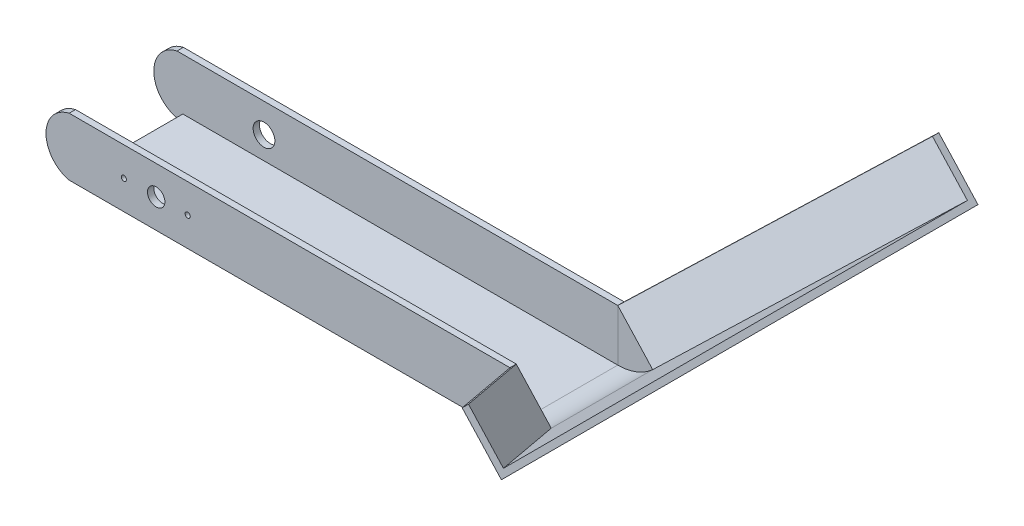
ISO-10303-21;
HEADER;
FILE_DESCRIPTION(('STEP AP214'),'2;1');
FILE_NAME('part.step','',(''),(''),'','','');
FILE_SCHEMA(('AUTOMOTIVE_DESIGN { 1 0 10303 214 1 1 1 1 }'));
ENDSEC;
DATA;
#1=APPLICATION_CONTEXT('core data for automotive mechanical design processes');
#2=APPLICATION_PROTOCOL_DEFINITION('international standard','automotive_design',2000,#1);
#3=PRODUCT_CONTEXT('',#1,'mechanical');
#4=PRODUCT('Part','Part','',(#3));
#5=PRODUCT_RELATED_PRODUCT_CATEGORY('part','',(#4));
#6=PRODUCT_DEFINITION_FORMATION('','',#4);
#7=PRODUCT_DEFINITION_CONTEXT('part definition',#1,'design');
#8=PRODUCT_DEFINITION('design','',#6,#7);
#9=PRODUCT_DEFINITION_SHAPE('','',#8);
#10=(LENGTH_UNIT() NAMED_UNIT(*) SI_UNIT(.MILLI.,.METRE.));
#11=(NAMED_UNIT(*) PLANE_ANGLE_UNIT() SI_UNIT($,.RADIAN.));
#12=(NAMED_UNIT(*) SI_UNIT($,.STERADIAN.) SOLID_ANGLE_UNIT());
#13=UNCERTAINTY_MEASURE_WITH_UNIT(LENGTH_MEASURE(1.E-05),#10,'distance_accuracy_value','');
#14=(GEOMETRIC_REPRESENTATION_CONTEXT(3) GLOBAL_UNCERTAINTY_ASSIGNED_CONTEXT((#13)) GLOBAL_UNIT_ASSIGNED_CONTEXT((#10,
#11,#12)) REPRESENTATION_CONTEXT('',''));
#15=CARTESIAN_POINT('',(0.,0.,0.));
#16=DIRECTION('',(0.,0.,1.));
#17=DIRECTION('',(1.,0.,0.));
#18=AXIS2_PLACEMENT_3D('',#15,#16,#17);
#19=CARTESIAN_POINT('',(-90.1530320109,-16.1412265646858,31.4271677660097));
#20=DIRECTION('',(0.,0.,-1.));
#21=DIRECTION('',(-1.,0.,0.));
#22=AXIS2_PLACEMENT_3D('',#19,#20,#21);
#23=CYLINDRICAL_SURFACE('',#22,13.0175006283313);
#24=CARTESIAN_POINT('',(-90.1530320109,-16.1412265646858,28.6585677660097));
#25=DIRECTION('',(0.,0.,1.));
#26=DIRECTION('',(1.,0.,0.));
#27=AXIS2_PLACEMENT_3D('',#24,#25,#26);
#28=CIRCLE('',#27,13.0175006283313);
#29=CARTESIAN_POINT('',(-93.0105371073609,-3.44122706735089,28.6585677660097));
#30=VERTEX_POINT('',#29);
#31=CARTESIAN_POINT('',(-93.0105326392311,-28.8412270673509,28.6585677660097));
#32=VERTEX_POINT('',#31);
#33=EDGE_CURVE('P0_E179',#30,#32,#28,.T.);
#34=ORIENTED_EDGE('',*,*,#33,.T.);
#35=DIRECTION('',(0.,0.,-1.));
#36=VECTOR('',#35,1.);
#37=CARTESIAN_POINT('',(-93.0105326392311,-28.8412270673509,31.4271677660097));
#38=LINE('',#37,#36);
#39=CARTESIAN_POINT('',(-93.0105326392311,-28.8412270673509,31.4271677660097));
#40=VERTEX_POINT('',#39);
#41=EDGE_CURVE('P0_E11',#40,#32,#38,.T.);
#42=ORIENTED_EDGE('',*,*,#41,.F.);
#43=CARTESIAN_POINT('',(-90.1530320109,-16.1412265646858,31.4271677660097));
#44=DIRECTION('',(0.,0.,1.));
#45=DIRECTION('',(1.,0.,0.));
#46=AXIS2_PLACEMENT_3D('',#43,#44,#45);
#47=CIRCLE('',#46,13.0175006283313);
#48=CARTESIAN_POINT('',(-93.0105371073609,-3.44122706735089,31.4271677660097));
#49=VERTEX_POINT('',#48);
#50=EDGE_CURVE('P0_E182',#49,#40,#47,.T.);
#51=ORIENTED_EDGE('',*,*,#50,.F.);
#52=DIRECTION('',(0.,0.,-1.));
#53=VECTOR('',#52,1.);
#54=CARTESIAN_POINT('',(-93.0105371073609,-3.44122706735089,31.4271677660097));
#55=LINE('',#54,#53);
#56=EDGE_CURVE('P0_E187',#49,#30,#55,.T.);
#57=ORIENTED_EDGE('',*,*,#56,.T.);
#58=EDGE_LOOP('',(#34,#42,#51,#57));
#59=FACE_BOUND('',#58,.T.);
#60=ADVANCED_FACE('P0_F17',(#59),#23,.T.);
#61=CARTESIAN_POINT('',(-93.0105326392311,-28.8412270673509,31.4271677660097));
#62=DIRECTION('',(0.,1.,0.));
#63=DIRECTION('',(0.,0.,1.));
#64=AXIS2_PLACEMENT_3D('',#61,#62,#63);
#65=PLANE('',#64);
#66=DIRECTION('',(1.,0.,0.));
#67=VECTOR('',#66,1.);
#68=CARTESIAN_POINT('',(-93.0105326392311,-28.8412270673509,28.6585677660097));
#69=LINE('',#68,#67);
#70=CARTESIAN_POINT('',(-90.4705326392312,-28.8412270673509,28.6585677660097));
#71=VERTEX_POINT('',#70);
#72=EDGE_CURVE('P0_E190',#32,#71,#69,.T.);
#73=ORIENTED_EDGE('',*,*,#72,.T.);
#74=DIRECTION('',(0.,0.,1.));
#75=VECTOR('',#74,1.);
#76=CARTESIAN_POINT('',(-90.4705326392312,-28.8412270673509,-15.7914322339903));
#77=LINE('',#76,#75);
#78=CARTESIAN_POINT('',(-90.4705326392312,-28.8412270673509,-15.7914322339903));
#79=VERTEX_POINT('',#78);
#80=EDGE_CURVE('P0_E31',#79,#71,#77,.T.);
#81=ORIENTED_EDGE('',*,*,#80,.F.);
#82=DIRECTION('',(-1.,0.,0.));
#83=VECTOR('',#82,1.);
#84=CARTESIAN_POINT('',(100.029467360769,-28.8412270673509,-15.7914322339903));
#85=LINE('',#84,#83);
#86=CARTESIAN_POINT('',(-93.0105326392311,-28.8412270673509,-15.7914322339903));
#87=VERTEX_POINT('',#86);
#88=EDGE_CURVE('P0_E136',#79,#87,#85,.T.);
#89=ORIENTED_EDGE('',*,*,#88,.T.);
#90=DIRECTION('',(0.,0.,1.));
#91=VECTOR('',#90,1.);
#92=CARTESIAN_POINT('',(-93.0105326392311,-28.8412270673509,-18.5600322339903));
#93=LINE('',#92,#91);
#94=CARTESIAN_POINT('',(-93.0105326392311,-28.8412270673509,-18.5600322339903));
#95=VERTEX_POINT('',#94);
#96=EDGE_CURVE('P0_E124',#95,#87,#93,.T.);
#97=ORIENTED_EDGE('',*,*,#96,.F.);
#98=DIRECTION('',(-1.,0.,0.));
#99=VECTOR('',#98,1.);
#100=CARTESIAN_POINT('',(100.029467360769,-28.8412270673509,-18.5600322339903));
#101=LINE('',#100,#99);
#102=CARTESIAN_POINT('',(100.029467360769,-28.8412270673509,-18.5600322339903));
#103=VERTEX_POINT('',#102);
#104=EDGE_CURVE('P0_E114',#103,#95,#101,.T.);
#105=ORIENTED_EDGE('',*,*,#104,.F.);
#106=DIRECTION('',(0.,0.,-1.));
#107=VECTOR('',#106,1.);
#108=CARTESIAN_POINT('',(100.029467360769,-28.8412270673509,31.4271677660097));
#109=LINE('',#108,#107);
#110=CARTESIAN_POINT('',(100.029467360769,-28.8412270673509,31.4271677660097));
#111=VERTEX_POINT('',#110);
#112=EDGE_CURVE('P0_E24',#111,#103,#109,.T.);
#113=ORIENTED_EDGE('',*,*,#112,.F.);
#114=DIRECTION('',(1.,0.,0.));
#115=VECTOR('',#114,1.);
#116=CARTESIAN_POINT('',(-93.0105326392311,-28.8412270673509,31.4271677660097));
#117=LINE('',#116,#115);
#118=EDGE_CURVE('P0_E65',#40,#111,#117,.T.);
#119=ORIENTED_EDGE('',*,*,#118,.F.);
#120=ORIENTED_EDGE('',*,*,#41,.T.);
#121=EDGE_LOOP('',(#73,#81,#89,#97,#105,#113,#119,#120));
#122=FACE_BOUND('',#121,.T.);
#123=ADVANCED_FACE('P0_F122',(#122),#65,.F.);
#124=CARTESIAN_POINT('',(100.029467360769,-28.8412270673509,31.4271677660097));
#125=DIRECTION('',(-1.,0.,0.));
#126=DIRECTION('',(0.,0.,1.));
#127=AXIS2_PLACEMENT_3D('',#124,#125,#126);
#128=PLANE('',#127);
#129=ORIENTED_EDGE('',*,*,#112,.T.);
#130=DIRECTION('',(0.,-1.,0.));
#131=VECTOR('',#130,1.);
#132=CARTESIAN_POINT('',(100.029467360769,-16.1412265646858,-18.5600322339903));
#133=LINE('',#132,#131);
#134=CARTESIAN_POINT('',(100.029467360769,-3.44122706735089,-18.5600322339903));
#135=VERTEX_POINT('',#134);
#136=EDGE_CURVE('P0_E107',#135,#103,#133,.T.);
#137=ORIENTED_EDGE('',*,*,#136,.F.);
#138=DIRECTION('',(0.,0.,1.));
#139=VECTOR('',#138,1.);
#140=CARTESIAN_POINT('',(100.029467360769,-3.44122706735089,-18.5600322339903));
#141=LINE('',#140,#139);
#142=CARTESIAN_POINT('',(100.029467360769,-3.44122706735089,-15.7914322339903));
#143=VERTEX_POINT('',#142);
#144=EDGE_CURVE('P0_E132',#135,#143,#141,.T.);
#145=ORIENTED_EDGE('',*,*,#144,.T.);
#146=DIRECTION('',(0.,-1.,0.));
#147=VECTOR('',#146,1.);
#148=CARTESIAN_POINT('',(100.029467360769,-16.1412265646858,-15.7914322339903));
#149=LINE('',#148,#147);
#150=CARTESIAN_POINT('',(100.029467360769,-26.0726270673509,-15.7914322339903));
#151=VERTEX_POINT('',#150);
#152=EDGE_CURVE('P0_E133',#143,#151,#149,.T.);
#153=ORIENTED_EDGE('',*,*,#152,.T.);
#154=DIRECTION('',(0.,0.,1.));
#155=VECTOR('',#154,1.);
#156=CARTESIAN_POINT('',(100.029467360769,-26.0726270673509,-15.7914322339903));
#157=LINE('',#156,#155);
#158=CARTESIAN_POINT('',(100.029467360769,-26.0726270673509,28.6585677660097));
#159=VERTEX_POINT('',#158);
#160=EDGE_CURVE('P0_E159',#151,#159,#157,.T.);
#161=ORIENTED_EDGE('',*,*,#160,.T.);
#162=DIRECTION('',(0.,1.,0.));
#163=VECTOR('',#162,1.);
#164=CARTESIAN_POINT('',(100.029467360769,-28.8412270673509,28.6585677660097));
#165=LINE('',#164,#163);
#166=CARTESIAN_POINT('',(100.029467360769,-3.44122706735089,28.6585677660097));
#167=VERTEX_POINT('',#166);
#168=EDGE_CURVE('P0_E192',#159,#167,#165,.T.);
#169=ORIENTED_EDGE('',*,*,#168,.T.);
#170=DIRECTION('',(0.,0.,-1.));
#171=VECTOR('',#170,1.);
#172=CARTESIAN_POINT('',(100.029467360769,-3.44122706735089,31.4271677660097));
#173=LINE('',#172,#171);
#174=CARTESIAN_POINT('',(100.029467360769,-3.44122706735089,31.4271677660097));
#175=VERTEX_POINT('',#174);
#176=EDGE_CURVE('P0_E111',#175,#167,#173,.T.);
#177=ORIENTED_EDGE('',*,*,#176,.F.);
#178=DIRECTION('',(0.,1.,0.));
#179=VECTOR('',#178,1.);
#180=CARTESIAN_POINT('',(100.029467360769,-28.8412270673509,31.4271677660097));
#181=LINE('',#180,#179);
#182=EDGE_CURVE('P0_E109',#111,#175,#181,.T.);
#183=ORIENTED_EDGE('',*,*,#182,.F.);
#184=EDGE_LOOP('',(#129,#137,#145,#153,#161,#169,#177,#183));
#185=FACE_BOUND('',#184,.T.);
#186=ADVANCED_FACE('P0_F105',(#185),#128,.F.);
#187=CARTESIAN_POINT('',(-93.0105371073609,-3.44122706735089,31.4271677660097));
#188=DIRECTION('',(0.,-1.,0.));
#189=DIRECTION('',(0.,0.,-1.));
#190=AXIS2_PLACEMENT_3D('',#187,#188,#189);
#191=PLANE('',#190);
#192=DIRECTION('',(-1.,0.,0.));
#193=VECTOR('',#192,1.);
#194=CARTESIAN_POINT('',(-93.0105371073609,-3.44122706735089,28.6585677660097));
#195=LINE('',#194,#193);
#196=EDGE_CURVE('P0_E58',#167,#30,#195,.T.);
#197=ORIENTED_EDGE('',*,*,#196,.T.);
#198=ORIENTED_EDGE('',*,*,#56,.F.);
#199=DIRECTION('',(-1.,0.,0.));
#200=VECTOR('',#199,1.);
#201=CARTESIAN_POINT('',(-93.0105371073609,-3.44122706735089,31.4271677660097));
#202=LINE('',#201,#200);
#203=EDGE_CURVE('P0_E40',#175,#49,#202,.T.);
#204=ORIENTED_EDGE('',*,*,#203,.F.);
#205=ORIENTED_EDGE('',*,*,#176,.T.);
#206=EDGE_LOOP('',(#197,#198,#204,#205));
#207=FACE_BOUND('',#206,.T.);
#208=ADVANCED_FACE('P0_F196',(#207),#191,.F.);
#209=CARTESIAN_POINT('',(-90.1530320109,-16.1412265646858,31.4271677660097));
#210=DIRECTION('',(0.,0.,1.));
#211=DIRECTION('',(1.,0.,0.));
#212=AXIS2_PLACEMENT_3D('',#209,#210,#211);
#213=PLANE('',#212);
#214=CARTESIAN_POINT('',(-69.0781994585354,-16.1412265646858,31.4271677660097));
#215=DIRECTION('',(0.,0.,1.));
#216=DIRECTION('',(1.,0.,0.));
#217=AXIS2_PLACEMENT_3D('',#214,#215,#216);
#218=CIRCLE('',#217,1.1303);
#219=CARTESIAN_POINT('',(-67.9478994585354,-16.1412265646858,31.4271677660097));
#220=VERTEX_POINT('',#219);
#221=EDGE_CURVE('P0_E161',#220,#220,#218,.T.);
#222=ORIENTED_EDGE('',*,*,#221,.F.);
#223=EDGE_LOOP('',(#222));
#224=FACE_BOUND('',#223,.T.);
#225=CARTESIAN_POINT('',(-41.1178794585354,-16.1412265646858,31.4271677660097));
#226=DIRECTION('',(0.,0.,1.));
#227=DIRECTION('',(1.,0.,0.));
#228=AXIS2_PLACEMENT_3D('',#225,#226,#227);
#229=CIRCLE('',#228,1.1303);
#230=CARTESIAN_POINT('',(-39.9875794585354,-16.1412265646858,31.4271677660097));
#231=VERTEX_POINT('',#230);
#232=EDGE_CURVE('P0_E168',#231,#231,#229,.T.);
#233=ORIENTED_EDGE('',*,*,#232,.F.);
#234=EDGE_LOOP('',(#233));
#235=FACE_BOUND('',#234,.T.);
#236=CARTESIAN_POINT('',(-54.9105326392313,-16.1412265646858,31.4271677660097));
#237=DIRECTION('',(0.,0.,1.));
#238=DIRECTION('',(1.,0.,0.));
#239=AXIS2_PLACEMENT_3D('',#236,#237,#238);
#240=CIRCLE('',#239,3.81);
#241=CARTESIAN_POINT('',(-51.1005326392313,-16.1412265646858,31.4271677660097));
#242=VERTEX_POINT('',#241);
#243=EDGE_CURVE('P0_E167',#242,#242,#240,.T.);
#244=ORIENTED_EDGE('',*,*,#243,.F.);
#245=EDGE_LOOP('',(#244));
#246=FACE_BOUND('',#245,.T.);
#247=ORIENTED_EDGE('',*,*,#50,.T.);
#248=ORIENTED_EDGE('',*,*,#118,.T.);
#249=ORIENTED_EDGE('',*,*,#182,.T.);
#250=ORIENTED_EDGE('',*,*,#203,.T.);
#251=EDGE_LOOP('',(#247,#248,#249,#250));
#252=FACE_BOUND('',#251,.T.);
#253=ADVANCED_FACE('P0_F204',(#224,#235,#246,#252),#213,.T.);
#254=CARTESIAN_POINT('',(-90.1530320109,-16.1412265646858,28.6585677660097));
#255=DIRECTION('',(0.,0.,1.));
#256=DIRECTION('',(1.,0.,0.));
#257=AXIS2_PLACEMENT_3D('',#254,#255,#256);
#258=PLANE('',#257);
#259=CARTESIAN_POINT('',(-69.0781994585354,-16.1412265646858,28.6585677660097));
#260=DIRECTION('',(0.,0.,1.));
#261=DIRECTION('',(1.,0.,0.));
#262=AXIS2_PLACEMENT_3D('',#259,#260,#261);
#263=CIRCLE('',#262,1.1303);
#264=CARTESIAN_POINT('',(-67.9478994585354,-16.1412265646858,28.6585677660097));
#265=VERTEX_POINT('',#264);
#266=EDGE_CURVE('P0_E171',#265,#265,#263,.T.);
#267=ORIENTED_EDGE('',*,*,#266,.T.);
#268=EDGE_LOOP('',(#267));
#269=FACE_BOUND('',#268,.T.);
#270=CARTESIAN_POINT('',(-41.1178794585354,-16.1412265646858,28.6585677660097));
#271=DIRECTION('',(0.,0.,1.));
#272=DIRECTION('',(1.,0.,0.));
#273=AXIS2_PLACEMENT_3D('',#270,#271,#272);
#274=CIRCLE('',#273,1.1303);
#275=CARTESIAN_POINT('',(-39.9875794585354,-16.1412265646858,28.6585677660097));
#276=VERTEX_POINT('',#275);
#277=EDGE_CURVE('P0_E164',#276,#276,#274,.T.);
#278=ORIENTED_EDGE('',*,*,#277,.T.);
#279=EDGE_LOOP('',(#278));
#280=FACE_BOUND('',#279,.T.);
#281=CARTESIAN_POINT('',(-54.9105326392313,-16.1412265646858,28.6585677660097));
#282=DIRECTION('',(0.,0.,1.));
#283=DIRECTION('',(1.,0.,0.));
#284=AXIS2_PLACEMENT_3D('',#281,#282,#283);
#285=CIRCLE('',#284,3.81);
#286=CARTESIAN_POINT('',(-51.1005326392313,-16.1412265646858,28.6585677660097));
#287=VERTEX_POINT('',#286);
#288=EDGE_CURVE('P0_E176',#287,#287,#285,.T.);
#289=ORIENTED_EDGE('',*,*,#288,.T.);
#290=EDGE_LOOP('',(#289));
#291=FACE_BOUND('',#290,.T.);
#292=ORIENTED_EDGE('',*,*,#168,.F.);
#293=DIRECTION('',(-1.,0.,0.));
#294=VECTOR('',#293,1.);
#295=CARTESIAN_POINT('',(-90.1530320109,-26.0726270673509,28.6585677660097));
#296=LINE('',#295,#294);
#297=CARTESIAN_POINT('',(-90.4705326392312,-26.0726270673509,28.6585677660097));
#298=VERTEX_POINT('',#297);
#299=EDGE_CURVE('P0_E148',#159,#298,#296,.T.);
#300=ORIENTED_EDGE('',*,*,#299,.T.);
#301=DIRECTION('',(0.,-1.,0.));
#302=VECTOR('',#301,1.);
#303=CARTESIAN_POINT('',(-90.4705326392312,-16.1412265646858,28.6585677660097));
#304=LINE('',#303,#302);
#305=EDGE_CURVE('P0_E153',#298,#71,#304,.T.);
#306=ORIENTED_EDGE('',*,*,#305,.T.);
#307=ORIENTED_EDGE('',*,*,#72,.F.);
#308=ORIENTED_EDGE('',*,*,#33,.F.);
#309=ORIENTED_EDGE('',*,*,#196,.F.);
#310=EDGE_LOOP('',(#292,#300,#306,#307,#308,#309));
#311=FACE_BOUND('',#310,.T.);
#312=ADVANCED_FACE('P0_F200',(#269,#280,#291,#311),#258,.F.);
#313=CARTESIAN_POINT('',(-54.9105326392313,-16.1412265646858,28.6585677660097));
#314=DIRECTION('',(0.,0.,1.));
#315=DIRECTION('',(1.,0.,0.));
#316=AXIS2_PLACEMENT_3D('',#313,#314,#315);
#317=CYLINDRICAL_SURFACE('',#316,3.81);
#318=ORIENTED_EDGE('',*,*,#288,.F.);
#319=EDGE_LOOP('',(#318));
#320=FACE_BOUND('',#319,.T.);
#321=ORIENTED_EDGE('',*,*,#243,.T.);
#322=EDGE_LOOP('',(#321));
#323=FACE_BOUND('',#322,.T.);
#324=ADVANCED_FACE('P0_F213',(#320,#323),#317,.F.);
#325=CARTESIAN_POINT('',(-41.1178794585354,-16.1412265646858,28.6585677660097));
#326=DIRECTION('',(0.,0.,1.));
#327=DIRECTION('',(1.,0.,0.));
#328=AXIS2_PLACEMENT_3D('',#325,#326,#327);
#329=CYLINDRICAL_SURFACE('',#328,1.1303);
#330=ORIENTED_EDGE('',*,*,#277,.F.);
#331=EDGE_LOOP('',(#330));
#332=FACE_BOUND('',#331,.T.);
#333=ORIENTED_EDGE('',*,*,#232,.T.);
#334=EDGE_LOOP('',(#333));
#335=FACE_BOUND('',#334,.T.);
#336=ADVANCED_FACE('P0_F258',(#332,#335),#329,.F.);
#337=CARTESIAN_POINT('',(-69.0781994585354,-16.1412265646858,28.6585677660097));
#338=DIRECTION('',(0.,0.,1.));
#339=DIRECTION('',(1.,0.,0.));
#340=AXIS2_PLACEMENT_3D('',#337,#338,#339);
#341=CYLINDRICAL_SURFACE('',#340,1.1303);
#342=ORIENTED_EDGE('',*,*,#266,.F.);
#343=EDGE_LOOP('',(#342));
#344=FACE_BOUND('',#343,.T.);
#345=ORIENTED_EDGE('',*,*,#221,.T.);
#346=EDGE_LOOP('',(#345));
#347=FACE_BOUND('',#346,.T.);
#348=ADVANCED_FACE('P0_F267',(#344,#347),#341,.F.);
#349=CARTESIAN_POINT('',(-90.1530320109,-26.0726270673509,-15.7914322339903));
#350=DIRECTION('',(0.,1.,0.));
#351=DIRECTION('',(0.,0.,1.));
#352=AXIS2_PLACEMENT_3D('',#349,#350,#351);
#353=PLANE('',#352);
#354=ORIENTED_EDGE('',*,*,#299,.F.);
#355=ORIENTED_EDGE('',*,*,#160,.F.);
#356=DIRECTION('',(-1.,0.,0.));
#357=VECTOR('',#356,1.);
#358=CARTESIAN_POINT('',(-90.1530320109,-26.0726270673509,-15.7914322339903));
#359=LINE('',#358,#357);
#360=CARTESIAN_POINT('',(-90.4705326392312,-26.0726270673509,-15.7914322339903));
#361=VERTEX_POINT('',#360);
#362=EDGE_CURVE('P0_E149',#151,#361,#359,.T.);
#363=ORIENTED_EDGE('',*,*,#362,.T.);
#364=DIRECTION('',(0.,0.,1.));
#365=VECTOR('',#364,1.);
#366=CARTESIAN_POINT('',(-90.4705326392312,-26.0726270673509,-15.7914322339903));
#367=LINE('',#366,#365);
#368=EDGE_CURVE('P0_E155',#361,#298,#367,.T.);
#369=ORIENTED_EDGE('',*,*,#368,.T.);
#370=EDGE_LOOP('',(#354,#355,#363,#369));
#371=FACE_BOUND('',#370,.T.);
#372=ADVANCED_FACE('P0_F277',(#371),#353,.T.);
#373=CARTESIAN_POINT('',(-90.4705326392312,-16.1412265646858,-15.7914322339903));
#374=DIRECTION('',(-1.,0.,0.));
#375=DIRECTION('',(0.,0.,1.));
#376=AXIS2_PLACEMENT_3D('',#373,#374,#375);
#377=PLANE('',#376);
#378=ORIENTED_EDGE('',*,*,#305,.F.);
#379=ORIENTED_EDGE('',*,*,#368,.F.);
#380=DIRECTION('',(0.,-1.,0.));
#381=VECTOR('',#380,1.);
#382=CARTESIAN_POINT('',(-90.4705326392312,-16.1412265646858,-15.7914322339903));
#383=LINE('',#382,#381);
#384=EDGE_CURVE('P0_E152',#361,#79,#383,.T.);
#385=ORIENTED_EDGE('',*,*,#384,.T.);
#386=ORIENTED_EDGE('',*,*,#80,.T.);
#387=EDGE_LOOP('',(#378,#379,#385,#386));
#388=FACE_BOUND('',#387,.T.);
#389=ADVANCED_FACE('P0_F287',(#388),#377,.T.);
#390=CARTESIAN_POINT('',(-90.1530320109,-16.1412265646858,-15.7914322339903));
#391=DIRECTION('',(0.,0.,1.));
#392=DIRECTION('',(1.,0.,0.));
#393=AXIS2_PLACEMENT_3D('',#390,#391,#392);
#394=PLANE('',#393);
#395=CARTESIAN_POINT('',(-54.9105326392313,-16.1412265646858,-15.7914322339903));
#396=DIRECTION('',(0.,0.,1.));
#397=DIRECTION('',(1.,0.,0.));
#398=AXIS2_PLACEMENT_3D('',#395,#396,#397);
#399=CIRCLE('',#398,4.7625);
#400=CARTESIAN_POINT('',(-50.1480326392313,-16.1412265646858,-15.7914322339903));
#401=VERTEX_POINT('',#400);
#402=EDGE_CURVE('P0_E137',#401,#401,#399,.T.);
#403=ORIENTED_EDGE('',*,*,#402,.F.);
#404=EDGE_LOOP('',(#403));
#405=FACE_BOUND('',#404,.T.);
#406=ORIENTED_EDGE('',*,*,#362,.F.);
#407=ORIENTED_EDGE('',*,*,#152,.F.);
#408=DIRECTION('',(1.,0.,0.));
#409=VECTOR('',#408,1.);
#410=CARTESIAN_POINT('',(-93.0105371073609,-3.44122706735089,-15.7914322339903));
#411=LINE('',#410,#409);
#412=CARTESIAN_POINT('',(-93.0105371073609,-3.44122706735089,-15.7914322339903));
#413=VERTEX_POINT('',#412);
#414=EDGE_CURVE('P0_E119',#413,#143,#411,.T.);
#415=ORIENTED_EDGE('',*,*,#414,.F.);
#416=CARTESIAN_POINT('',(-90.1530320109,-16.1412265646858,-15.7914322339903));
#417=DIRECTION('',(0.,0.,-1.));
#418=DIRECTION('',(1.,0.,0.));
#419=AXIS2_PLACEMENT_3D('',#416,#417,#418);
#420=CIRCLE('',#419,13.0175006283313);
#421=EDGE_CURVE('P0_E139',#87,#413,#420,.T.);
#422=ORIENTED_EDGE('',*,*,#421,.F.);
#423=ORIENTED_EDGE('',*,*,#88,.F.);
#424=ORIENTED_EDGE('',*,*,#384,.F.);
#425=EDGE_LOOP('',(#406,#407,#415,#422,#423,#424));
#426=FACE_BOUND('',#425,.T.);
#427=ADVANCED_FACE('P0_F297',(#405,#426),#394,.T.);
#428=CARTESIAN_POINT('',(-90.1530320109,-16.1412265646858,-18.5600322339903));
#429=DIRECTION('',(0.,0.,1.));
#430=DIRECTION('',(1.,0.,0.));
#431=AXIS2_PLACEMENT_3D('',#428,#429,#430);
#432=CYLINDRICAL_SURFACE('',#431,13.0175006283313);
#433=ORIENTED_EDGE('',*,*,#421,.T.);
#434=DIRECTION('',(0.,0.,1.));
#435=VECTOR('',#434,1.);
#436=CARTESIAN_POINT('',(-93.0105371073609,-3.44122706735089,-18.5600322339903));
#437=LINE('',#436,#435);
#438=CARTESIAN_POINT('',(-93.0105371073609,-3.44122706735089,-18.5600322339903));
#439=VERTEX_POINT('',#438);
#440=EDGE_CURVE('P0_E144',#439,#413,#437,.T.);
#441=ORIENTED_EDGE('',*,*,#440,.F.);
#442=CARTESIAN_POINT('',(-90.1530320109,-16.1412265646858,-18.5600322339903));
#443=DIRECTION('',(0.,0.,-1.));
#444=DIRECTION('',(1.,0.,0.));
#445=AXIS2_PLACEMENT_3D('',#442,#443,#444);
#446=CIRCLE('',#445,13.0175006283313);
#447=EDGE_CURVE('P0_E126',#95,#439,#446,.T.);
#448=ORIENTED_EDGE('',*,*,#447,.F.);
#449=ORIENTED_EDGE('',*,*,#96,.T.);
#450=EDGE_LOOP('',(#433,#441,#448,#449));
#451=FACE_BOUND('',#450,.T.);
#452=ADVANCED_FACE('P0_F306',(#451),#432,.T.);
#453=CARTESIAN_POINT('',(-93.0105371073609,-3.44122706735089,-18.5600322339903));
#454=DIRECTION('',(0.,-1.,0.));
#455=DIRECTION('',(0.,0.,-1.));
#456=AXIS2_PLACEMENT_3D('',#453,#454,#455);
#457=PLANE('',#456);
#458=ORIENTED_EDGE('',*,*,#414,.T.);
#459=ORIENTED_EDGE('',*,*,#144,.F.);
#460=DIRECTION('',(1.,0.,0.));
#461=VECTOR('',#460,1.);
#462=CARTESIAN_POINT('',(-93.0105371073609,-3.44122706735089,-18.5600322339903));
#463=LINE('',#462,#461);
#464=EDGE_CURVE('P0_E117',#439,#135,#463,.T.);
#465=ORIENTED_EDGE('',*,*,#464,.F.);
#466=ORIENTED_EDGE('',*,*,#440,.T.);
#467=EDGE_LOOP('',(#458,#459,#465,#466));
#468=FACE_BOUND('',#467,.T.);
#469=ADVANCED_FACE('P0_F316',(#468),#457,.F.);
#470=CARTESIAN_POINT('',(-90.1530320109,-16.1412265646858,-18.5600322339903));
#471=DIRECTION('',(0.,0.,1.));
#472=DIRECTION('',(1.,0.,0.));
#473=AXIS2_PLACEMENT_3D('',#470,#471,#472);
#474=PLANE('',#473);
#475=CARTESIAN_POINT('',(-54.9105326392313,-16.1412265646858,-18.5600322339903));
#476=DIRECTION('',(0.,0.,1.));
#477=DIRECTION('',(1.,0.,0.));
#478=AXIS2_PLACEMENT_3D('',#475,#476,#477);
#479=CIRCLE('',#478,4.7625);
#480=CARTESIAN_POINT('',(-50.1480326392313,-16.1412265646858,-18.5600322339903));
#481=VERTEX_POINT('',#480);
#482=EDGE_CURVE('P0_E354',#481,#481,#479,.T.);
#483=ORIENTED_EDGE('',*,*,#482,.T.);
#484=EDGE_LOOP('',(#483));
#485=FACE_BOUND('',#484,.T.);
#486=ORIENTED_EDGE('',*,*,#136,.T.);
#487=ORIENTED_EDGE('',*,*,#104,.T.);
#488=ORIENTED_EDGE('',*,*,#447,.T.);
#489=ORIENTED_EDGE('',*,*,#464,.T.);
#490=EDGE_LOOP('',(#486,#487,#488,#489));
#491=FACE_BOUND('',#490,.T.);
#492=ADVANCED_FACE('P0_F113',(#485,#491),#474,.F.);
#493=CARTESIAN_POINT('',(-54.9105326392313,-16.1412265646858,-2.3210480523866));
#494=DIRECTION('',(0.,0.,-1.));
#495=DIRECTION('',(-1.,0.,0.));
#496=AXIS2_PLACEMENT_3D('',#493,#494,#495);
#497=CYLINDRICAL_SURFACE('',#496,4.7625);
#498=ORIENTED_EDGE('',*,*,#482,.F.);
#499=EDGE_LOOP('',(#498));
#500=FACE_BOUND('',#499,.T.);
#501=ORIENTED_EDGE('',*,*,#402,.T.);
#502=EDGE_LOOP('',(#501));
#503=FACE_BOUND('',#502,.T.);
#504=ADVANCED_FACE('P0_F335',(#500,#503),#497,.F.);
#505=CLOSED_SHELL('',(#60,#123,#186,#208,#253,#312,#324,#336,#348,#372,#389,#427,#452,#469,#492,#504));
#506=MANIFOLD_SOLID_BREP('P0_B1',#505);
#507=CARTESIAN_POINT('',(81.3265376483104,-20.648913669209,-15.7914322339902));
#508=DIRECTION('',(0.,0.,-1.));
#509=DIRECTION('',(-0.736335815451119,-0.676616262651095,0.));
#510=AXIS2_PLACEMENT_3D('',#507,#508,#509);
#511=PLANE('',#510);
#512=CARTESIAN_POINT('',(100.08480915517,-3.5230869736741,-15.7914322339902));
#513=DIRECTION('',(0.,0.,-1.));
#514=DIRECTION('',(-0.736335815451119,-0.676616262651095,0.));
#515=AXIS2_PLACEMENT_3D('',#512,#513,#514);
#516=CIRCLE('',#515,22.5496080043655);
#517=CARTESIAN_POINT('',(115.342240647331,-20.1271709716716,-15.7914322339902));
#518=VERTEX_POINT('',#517);
#519=CARTESIAN_POINT('',(100.029467360769,-26.0726270673509,-15.7914322339902));
#520=VERTEX_POINT('',#519);
#521=EDGE_CURVE('P1_E123',#518,#520,#516,.T.);
#522=ORIENTED_EDGE('',*,*,#521,.F.);
#523=DIRECTION('',(0.676616262651095,-0.736335815451119,0.));
#524=VECTOR('',#523,1.);
#525=CARTESIAN_POINT('',(100.029467360769,-3.46286059787116,-15.7914322339902));
#526=LINE('',#525,#524);
#527=CARTESIAN_POINT('',(100.029467360769,-3.46286059787116,-15.7914322339902));
#528=VERTEX_POINT('',#527);
#529=EDGE_CURVE('P1_E152',#528,#518,#526,.T.);
#530=ORIENTED_EDGE('',*,*,#529,.F.);
#531=DIRECTION('',(0.,1.,0.));
#532=VECTOR('',#531,1.);
#533=CARTESIAN_POINT('',(100.029467360769,-3.46286059787116,-15.7914322339902));
#534=LINE('',#533,#532);
#535=EDGE_CURVE('P1_E138',#520,#528,#534,.T.);
#536=ORIENTED_EDGE('',*,*,#535,.F.);
#537=EDGE_LOOP('',(#522,#530,#536));
#538=FACE_BOUND('',#537,.T.);
#539=ADVANCED_FACE('P1_F17',(#538),#511,.F.);
#540=CARTESIAN_POINT('',(100.029467360769,-3.46286059787116,28.6585677660098));
#541=DIRECTION('',(-0.520668048336013,-0.478439947581688,0.707106781186546));
#542=DIRECTION('',(0.520668048336012,0.478439947581687,0.707106781186549));
#543=AXIS2_PLACEMENT_3D('',#540,#541,#542);
#544=PLANE('',#543);
#545=DIRECTION('',(0.676616262651095,-0.736335815451119,0.));
#546=VECTOR('',#545,1.);
#547=CARTESIAN_POINT('',(158.476122712201,50.2435552500595,108.03356776601));
#548=LINE('',#547,#546);
#549=CARTESIAN_POINT('',(158.476122712201,50.2435552500595,108.03356776601));
#550=VERTEX_POINT('',#549);
#551=CARTESIAN_POINT('',(173.788895998763,33.5792448762591,108.03356776601));
#552=VERTEX_POINT('',#551);
#553=EDGE_CURVE('P1_E32',#550,#552,#548,.T.);
#554=ORIENTED_EDGE('',*,*,#553,.T.);
#555=DIRECTION('',(0.520668048336012,0.478439947581687,0.707106781186549));
#556=VECTOR('',#555,1.);
#557=CARTESIAN_POINT('',(115.342240647331,-20.1271709716716,28.6585677660098));
#558=LINE('',#557,#556);
#559=CARTESIAN_POINT('',(115.342240647331,-20.1271709716716,28.6585677660097));
#560=VERTEX_POINT('',#559);
#561=EDGE_CURVE('P1_E166',#560,#552,#558,.T.);
#562=ORIENTED_EDGE('',*,*,#561,.F.);
#563=DIRECTION('',(0.676616262651095,-0.736335815451119,0.));
#564=VECTOR('',#563,1.);
#565=CARTESIAN_POINT('',(100.029467360769,-3.46286059787116,28.6585677660098));
#566=LINE('',#565,#564);
#567=CARTESIAN_POINT('',(100.029467360769,-3.46286059787116,28.6585677660098));
#568=VERTEX_POINT('',#567);
#569=EDGE_CURVE('P1_E11',#568,#560,#566,.T.);
#570=ORIENTED_EDGE('',*,*,#569,.F.);
#571=DIRECTION('',(-0.520668048336012,-0.478439947581687,-0.707106781186549));
#572=VECTOR('',#571,1.);
#573=CARTESIAN_POINT('',(100.029467360769,-3.46286059787116,28.6585677660098));
#574=LINE('',#573,#572);
#575=EDGE_CURVE('P1_E60',#550,#568,#574,.T.);
#576=ORIENTED_EDGE('',*,*,#575,.F.);
#577=EDGE_LOOP('',(#554,#562,#570,#576));
#578=FACE_BOUND('',#577,.T.);
#579=ADVANCED_FACE('P1_F19',(#578),#544,.F.);
#580=CARTESIAN_POINT('',(99.0101576914399,-4.39950049025907,30.0428677660098));
#581=DIRECTION('',(0.520668048336013,0.478439947581688,-0.707106781186547));
#582=DIRECTION('',(-0.520668048336012,-0.478439947581687,-0.707106781186548));
#583=AXIS2_PLACEMENT_3D('',#580,#581,#582);
#584=PLANE('',#583);
#585=DIRECTION('',(0.520668048336012,0.478439947581687,0.707106781186548));
#586=VECTOR('',#585,1.);
#587=CARTESIAN_POINT('',(116.196210762778,-23.1024302027175,30.0428677660098));
#588=LINE('',#587,#586);
#589=CARTESIAN_POINT('',(117.215520432107,-22.1657903103296,31.4271677660098));
#590=VERTEX_POINT('',#589);
#591=CARTESIAN_POINT('',(175.662175783539,31.5406255376011,110.80216776601));
#592=VERTEX_POINT('',#591);
#593=EDGE_CURVE('P1_E56',#590,#592,#588,.T.);
#594=ORIENTED_EDGE('',*,*,#593,.T.);
#595=DIRECTION('',(0.676616262651095,-0.736335815451119,0.));
#596=VECTOR('',#595,1.);
#597=CARTESIAN_POINT('',(158.476122712201,50.2435552500595,110.80216776601));
#598=LINE('',#597,#596);
#599=CARTESIAN_POINT('',(158.476122712201,50.2435552500595,110.80216776601));
#600=VERTEX_POINT('',#599);
#601=EDGE_CURVE('P1_E188',#600,#592,#598,.T.);
#602=ORIENTED_EDGE('',*,*,#601,.F.);
#603=DIRECTION('',(0.520668048336012,0.478439947581687,0.707106781186548));
#604=VECTOR('',#603,1.);
#605=CARTESIAN_POINT('',(99.0101576914399,-4.39950049025907,30.0428677660098));
#606=LINE('',#605,#604);
#607=CARTESIAN_POINT('',(100.029467360769,-3.46286059787116,31.4271677660098));
#608=VERTEX_POINT('',#607);
#609=EDGE_CURVE('P1_E181',#608,#600,#606,.T.);
#610=ORIENTED_EDGE('',*,*,#609,.F.);
#611=DIRECTION('',(0.676616262651095,-0.736335815451119,0.));
#612=VECTOR('',#611,1.);
#613=CARTESIAN_POINT('',(100.029467360769,-3.46286059787116,31.4271677660098));
#614=LINE('',#613,#612);
#615=EDGE_CURVE('P1_E25',#608,#590,#614,.T.);
#616=ORIENTED_EDGE('',*,*,#615,.T.);
#617=EDGE_LOOP('',(#594,#602,#610,#616));
#618=FACE_BOUND('',#617,.T.);
#619=ADVANCED_FACE('P1_F190',(#618),#584,.F.);
#620=CARTESIAN_POINT('',(158.476122712201,50.2435552500595,28.6585677660098));
#621=DIRECTION('',(-0.736335815451119,-0.676616262651095,0.));
#622=DIRECTION('',(0.,0.,1.));
#623=AXIS2_PLACEMENT_3D('',#620,#621,#622);
#624=PLANE('',#623);
#625=DIRECTION('',(0.,0.,-1.));
#626=VECTOR('',#625,1.);
#627=CARTESIAN_POINT('',(175.662175783539,31.5406255376011,28.6585677660098));
#628=LINE('',#627,#626);
#629=CARTESIAN_POINT('',(175.662175783539,31.5406255376011,-97.93503223399));
#630=VERTEX_POINT('',#629);
#631=EDGE_CURVE('P1_E179',#592,#630,#628,.T.);
#632=ORIENTED_EDGE('',*,*,#631,.T.);
#633=DIRECTION('',(0.676616262651095,-0.736335815451119,0.));
#634=VECTOR('',#633,1.);
#635=CARTESIAN_POINT('',(158.476122712201,50.2435552500596,-97.93503223399));
#636=LINE('',#635,#634);
#637=CARTESIAN_POINT('',(158.476122712201,50.2435552500596,-97.93503223399));
#638=VERTEX_POINT('',#637);
#639=EDGE_CURVE('P1_E160',#638,#630,#636,.T.);
#640=ORIENTED_EDGE('',*,*,#639,.F.);
#641=DIRECTION('',(0.,0.,-1.));
#642=VECTOR('',#641,1.);
#643=CARTESIAN_POINT('',(158.476122712201,50.2435552500595,28.6585677660098));
#644=LINE('',#643,#642);
#645=CARTESIAN_POINT('',(158.476122712201,50.2435552500595,-95.16643223399));
#646=VERTEX_POINT('',#645);
#647=EDGE_CURVE('P1_E147',#646,#638,#644,.T.);
#648=ORIENTED_EDGE('',*,*,#647,.F.);
#649=DIRECTION('',(0.676616262651095,-0.736335815451119,0.));
#650=VECTOR('',#649,1.);
#651=CARTESIAN_POINT('',(158.476122712201,50.2435552500595,-95.16643223399));
#652=LINE('',#651,#650);
#653=CARTESIAN_POINT('',(173.788895998763,33.5792448762591,-95.16643223399));
#654=VERTEX_POINT('',#653);
#655=EDGE_CURVE('P1_E163',#646,#654,#652,.T.);
#656=ORIENTED_EDGE('',*,*,#655,.T.);
#657=DIRECTION('',(0.,0.,-1.));
#658=VECTOR('',#657,1.);
#659=CARTESIAN_POINT('',(173.788895998763,33.5792448762591,108.03356776601));
#660=LINE('',#659,#658);
#661=EDGE_CURVE('P1_E169',#552,#654,#660,.T.);
#662=ORIENTED_EDGE('',*,*,#661,.F.);
#663=ORIENTED_EDGE('',*,*,#553,.F.);
#664=DIRECTION('',(0.,0.,-1.));
#665=VECTOR('',#664,1.);
#666=CARTESIAN_POINT('',(158.476122712201,50.2435552500595,28.6585677660098));
#667=LINE('',#666,#665);
#668=EDGE_CURVE('P1_E41',#600,#550,#667,.T.);
#669=ORIENTED_EDGE('',*,*,#668,.F.);
#670=ORIENTED_EDGE('',*,*,#601,.T.);
#671=EDGE_LOOP('',(#632,#640,#648,#656,#662,#663,#669,#670));
#672=FACE_BOUND('',#671,.T.);
#673=ADVANCED_FACE('P1_F197',(#672),#624,.F.);
#674=CARTESIAN_POINT('',(100.029467360769,-3.46286059787116,28.6585677660098));
#675=DIRECTION('',(-0.676616262651095,0.736335815451119,0.));
#676=DIRECTION('',(0.736335815451119,0.676616262651095,0.));
#677=AXIS2_PLACEMENT_3D('',#674,#675,#676);
#678=PLANE('',#677);
#679=ORIENTED_EDGE('',*,*,#575,.T.);
#680=DIRECTION('',(0.,0.,1.));
#681=VECTOR('',#680,1.);
#682=CARTESIAN_POINT('',(100.029467360769,-3.46286059787116,28.6585677660098));
#683=LINE('',#682,#681);
#684=EDGE_CURVE('P1_E178',#568,#608,#683,.T.);
#685=ORIENTED_EDGE('',*,*,#684,.T.);
#686=ORIENTED_EDGE('',*,*,#609,.T.);
#687=ORIENTED_EDGE('',*,*,#668,.T.);
#688=EDGE_LOOP('',(#679,#685,#686,#687));
#689=FACE_BOUND('',#688,.T.);
#690=ADVANCED_FACE('P1_F242',(#689),#678,.T.);
#691=CARTESIAN_POINT('',(117.215520432107,-22.1657903103296,28.6585677660098));
#692=DIRECTION('',(-0.676616262651095,0.736335815451119,0.));
#693=DIRECTION('',(0.736335815451119,0.676616262651095,0.));
#694=AXIS2_PLACEMENT_3D('',#691,#692,#693);
#695=PLANE('',#694);
#696=DIRECTION('',(0.,0.,1.));
#697=VECTOR('',#696,1.);
#698=CARTESIAN_POINT('',(117.215520432107,-22.1657903103296,28.6585677660098));
#699=LINE('',#698,#697);
#700=CARTESIAN_POINT('',(117.215520432107,-22.1657903103296,-18.5600322339902));
#701=VERTEX_POINT('',#700);
#702=EDGE_CURVE('P1_E121',#701,#590,#699,.T.);
#703=ORIENTED_EDGE('',*,*,#702,.F.);
#704=DIRECTION('',(-0.520668048336013,-0.478439947581688,0.707106781186546));
#705=VECTOR('',#704,1.);
#706=CARTESIAN_POINT('',(99.8311472643766,-38.1402266401381,5.0492677660097));
#707=LINE('',#706,#705);
#708=EDGE_CURVE('P1_E140',#630,#701,#707,.T.);
#709=ORIENTED_EDGE('',*,*,#708,.F.);
#710=ORIENTED_EDGE('',*,*,#631,.F.);
#711=ORIENTED_EDGE('',*,*,#593,.F.);
#712=EDGE_LOOP('',(#703,#709,#710,#711));
#713=FACE_BOUND('',#712,.T.);
#714=ADVANCED_FACE('P1_F193',(#713),#695,.F.);
#715=CARTESIAN_POINT('',(115.342240647331,-20.1271709716716,28.6585677660098));
#716=DIRECTION('',(-0.676616262651095,0.736335815451119,0.));
#717=DIRECTION('',(0.736335815451119,0.676616262651095,0.));
#718=AXIS2_PLACEMENT_3D('',#715,#716,#717);
#719=PLANE('',#718);
#720=ORIENTED_EDGE('',*,*,#561,.T.);
#721=ORIENTED_EDGE('',*,*,#661,.T.);
#722=DIRECTION('',(-0.520668048336013,-0.478439947581688,0.707106781186546));
#723=VECTOR('',#722,1.);
#724=CARTESIAN_POINT('',(115.342240647331,-20.1271709716716,-15.7914322339902));
#725=LINE('',#724,#723);
#726=EDGE_CURVE('P1_E171',#654,#518,#725,.T.);
#727=ORIENTED_EDGE('',*,*,#726,.T.);
#728=DIRECTION('',(0.,0.,1.));
#729=VECTOR('',#728,1.);
#730=CARTESIAN_POINT('',(115.342240647331,-20.1271709716716,28.6585677660098));
#731=LINE('',#730,#729);
#732=EDGE_CURVE('P1_E174',#518,#560,#731,.T.);
#733=ORIENTED_EDGE('',*,*,#732,.T.);
#734=EDGE_LOOP('',(#720,#721,#727,#733));
#735=FACE_BOUND('',#734,.T.);
#736=ADVANCED_FACE('P1_F212',(#735),#719,.T.);
#737=CARTESIAN_POINT('',(83.6644038623677,-18.5006570352918,6.43356776600971));
#738=DIRECTION('',(-0.520668048336011,-0.478439947581687,-0.707106781186549));
#739=DIRECTION('',(-0.520668048336013,-0.478439947581688,0.707106781186546));
#740=AXIS2_PLACEMENT_3D('',#737,#738,#739);
#741=PLANE('',#740);
#742=ORIENTED_EDGE('',*,*,#726,.F.);
#743=ORIENTED_EDGE('',*,*,#655,.F.);
#744=DIRECTION('',(0.520668048336013,0.478439947581688,-0.707106781186546));
#745=VECTOR('',#744,1.);
#746=CARTESIAN_POINT('',(83.6644038623677,-18.5006570352918,6.43356776600971));
#747=LINE('',#746,#745);
#748=EDGE_CURVE('P1_E144',#528,#646,#747,.T.);
#749=ORIENTED_EDGE('',*,*,#748,.F.);
#750=ORIENTED_EDGE('',*,*,#529,.T.);
#751=EDGE_LOOP('',(#742,#743,#749,#750));
#752=FACE_BOUND('',#751,.T.);
#753=ADVANCED_FACE('P1_F210',(#752),#741,.F.);
#754=CARTESIAN_POINT('',(82.6450941930387,-19.4372969276797,5.0492677660097));
#755=DIRECTION('',(0.520668048336011,0.478439947581687,0.707106781186549));
#756=DIRECTION('',(0.520668048336013,0.478439947581688,-0.707106781186546));
#757=AXIS2_PLACEMENT_3D('',#754,#755,#756);
#758=PLANE('',#757);
#759=ORIENTED_EDGE('',*,*,#708,.T.);
#760=DIRECTION('',(0.676616262651095,-0.736335815451119,0.));
#761=VECTOR('',#760,1.);
#762=CARTESIAN_POINT('',(100.029467360769,-3.46286059787116,-18.5600322339902));
#763=LINE('',#762,#761);
#764=CARTESIAN_POINT('',(100.029467360769,-3.46286059787116,-18.5600322339902));
#765=VERTEX_POINT('',#764);
#766=EDGE_CURVE('P1_E157',#765,#701,#763,.T.);
#767=ORIENTED_EDGE('',*,*,#766,.F.);
#768=DIRECTION('',(-0.520668048336013,-0.478439947581688,0.707106781186546));
#769=VECTOR('',#768,1.);
#770=CARTESIAN_POINT('',(82.6450941930387,-19.4372969276797,5.0492677660097));
#771=LINE('',#770,#769);
#772=EDGE_CURVE('P1_E149',#638,#765,#771,.T.);
#773=ORIENTED_EDGE('',*,*,#772,.F.);
#774=ORIENTED_EDGE('',*,*,#639,.T.);
#775=EDGE_LOOP('',(#759,#767,#773,#774));
#776=FACE_BOUND('',#775,.T.);
#777=ADVANCED_FACE('P1_F200',(#776),#758,.F.);
#778=CARTESIAN_POINT('',(100.029467360769,-3.46286059787116,28.6585677660098));
#779=DIRECTION('',(-0.676616262651095,0.736335815451119,0.));
#780=DIRECTION('',(0.736335815451119,0.676616262651095,0.));
#781=AXIS2_PLACEMENT_3D('',#778,#779,#780);
#782=PLANE('',#781);
#783=DIRECTION('',(0.,0.,-1.));
#784=VECTOR('',#783,1.);
#785=CARTESIAN_POINT('',(100.029467360769,-3.46286059787116,20.1295922502864));
#786=LINE('',#785,#784);
#787=EDGE_CURVE('P1_E115',#528,#765,#786,.T.);
#788=ORIENTED_EDGE('',*,*,#787,.F.);
#789=ORIENTED_EDGE('',*,*,#748,.T.);
#790=ORIENTED_EDGE('',*,*,#647,.T.);
#791=ORIENTED_EDGE('',*,*,#772,.T.);
#792=EDGE_LOOP('',(#788,#789,#790,#791));
#793=FACE_BOUND('',#792,.T.);
#794=ADVANCED_FACE('P1_F204',(#793),#782,.T.);
#795=CARTESIAN_POINT('',(98.5125907196482,-39.3518433816674,-18.5600322339902));
#796=DIRECTION('',(0.,0.,1.));
#797=DIRECTION('',(0.736335815451119,0.676616262651095,0.));
#798=AXIS2_PLACEMENT_3D('',#795,#796,#797);
#799=PLANE('',#798);
#800=DIRECTION('',(0.93175575910647,0.363085672220655,0.));
#801=VECTOR('',#800,1.);
#802=CARTESIAN_POINT('',(100.029467360769,-28.8628346497287,-18.5600322339902));
#803=LINE('',#802,#801);
#804=CARTESIAN_POINT('',(100.029467360769,-28.8628346497287,-18.5600322339902));
#805=VERTEX_POINT('',#804);
#806=EDGE_CURVE('P1_E116',#805,#701,#803,.T.);
#807=ORIENTED_EDGE('',*,*,#806,.F.);
#808=DIRECTION('',(0.,-1.,0.));
#809=VECTOR('',#808,1.);
#810=CARTESIAN_POINT('',(100.029467360769,-3.46286059787116,-18.5600322339902));
#811=LINE('',#810,#809);
#812=EDGE_CURVE('P1_E111',#765,#805,#811,.T.);
#813=ORIENTED_EDGE('',*,*,#812,.F.);
#814=ORIENTED_EDGE('',*,*,#766,.T.);
#815=EDGE_LOOP('',(#807,#813,#814));
#816=FACE_BOUND('',#815,.T.);
#817=ADVANCED_FACE('P1_F230',(#816),#799,.F.);
#818=CARTESIAN_POINT('',(100.029467360769,-3.46286059787116,20.1295922502864));
#819=DIRECTION('',(1.,0.,0.));
#820=DIRECTION('',(0.,-1.,0.));
#821=AXIS2_PLACEMENT_3D('',#818,#819,#820);
#822=PLANE('',#821);
#823=DIRECTION('',(0.,0.,-1.));
#824=VECTOR('',#823,1.);
#825=CARTESIAN_POINT('',(100.029467360769,-28.8628346497287,20.1295922502864));
#826=LINE('',#825,#824);
#827=CARTESIAN_POINT('',(100.029467360769,-28.8628346497287,31.4271677660097));
#828=VERTEX_POINT('',#827);
#829=EDGE_CURVE('P1_E103',#828,#805,#826,.T.);
#830=ORIENTED_EDGE('',*,*,#829,.F.);
#831=DIRECTION('',(0.,-1.,0.));
#832=VECTOR('',#831,1.);
#833=CARTESIAN_POINT('',(100.029467360769,-3.46286059787116,31.4271677660097));
#834=LINE('',#833,#832);
#835=EDGE_CURVE('P1_E108',#608,#828,#834,.T.);
#836=ORIENTED_EDGE('',*,*,#835,.F.);
#837=ORIENTED_EDGE('',*,*,#684,.F.);
#838=DIRECTION('',(0.,-1.,0.));
#839=VECTOR('',#838,1.);
#840=CARTESIAN_POINT('',(100.029467360769,-3.46286059787116,28.6585677660098));
#841=LINE('',#840,#839);
#842=CARTESIAN_POINT('',(100.029467360769,-26.0726270673509,28.6585677660097));
#843=VERTEX_POINT('',#842);
#844=EDGE_CURVE('P1_E126',#568,#843,#841,.T.);
#845=ORIENTED_EDGE('',*,*,#844,.T.);
#846=DIRECTION('',(0.,0.,-1.));
#847=VECTOR('',#846,1.);
#848=CARTESIAN_POINT('',(100.029467360769,-26.0726270673509,47.9445900306164));
#849=LINE('',#848,#847);
#850=EDGE_CURVE('P1_E133',#843,#520,#849,.T.);
#851=ORIENTED_EDGE('',*,*,#850,.T.);
#852=ORIENTED_EDGE('',*,*,#535,.T.);
#853=ORIENTED_EDGE('',*,*,#787,.T.);
#854=ORIENTED_EDGE('',*,*,#812,.T.);
#855=EDGE_LOOP('',(#830,#836,#837,#845,#851,#852,#853,#854));
#856=FACE_BOUND('',#855,.T.);
#857=ADVANCED_FACE('P1_F105',(#856),#822,.F.);
#858=CARTESIAN_POINT('',(100.029467360769,-28.8628346497287,20.1295922502864));
#859=DIRECTION('',(-0.363085672220655,0.93175575910647,0.));
#860=DIRECTION('',(0.931755759106471,0.363085672220655,0.));
#861=AXIS2_PLACEMENT_3D('',#858,#859,#860);
#862=PLANE('',#861);
#863=ORIENTED_EDGE('',*,*,#806,.T.);
#864=ORIENTED_EDGE('',*,*,#702,.T.);
#865=DIRECTION('',(0.93175575910647,0.363085672220655,0.));
#866=VECTOR('',#865,1.);
#867=CARTESIAN_POINT('',(100.029467360769,-28.8628346497287,31.4271677660097));
#868=LINE('',#867,#866);
#869=EDGE_CURVE('P1_E119',#828,#590,#868,.T.);
#870=ORIENTED_EDGE('',*,*,#869,.F.);
#871=ORIENTED_EDGE('',*,*,#829,.T.);
#872=EDGE_LOOP('',(#863,#864,#870,#871));
#873=FACE_BOUND('',#872,.T.);
#874=ADVANCED_FACE('P1_F120',(#873),#862,.F.);
#875=CARTESIAN_POINT('',(100.08480915517,-3.5230869736741,47.9445900306164));
#876=DIRECTION('',(0.,0.,-1.));
#877=DIRECTION('',(-0.736335815451119,-0.676616262651095,0.));
#878=AXIS2_PLACEMENT_3D('',#875,#876,#877);
#879=CYLINDRICAL_SURFACE('',#878,22.5496080043655);
#880=CARTESIAN_POINT('',(100.08480915517,-3.5230869736741,28.6585677660097));
#881=DIRECTION('',(0.,0.,1.));
#882=DIRECTION('',(0.736335815451119,0.676616262651095,0.));
#883=AXIS2_PLACEMENT_3D('',#880,#881,#882);
#884=CIRCLE('',#883,22.5496080043655);
#885=EDGE_CURVE('P1_E134',#560,#843,#884,.F.);
#886=ORIENTED_EDGE('',*,*,#885,.F.);
#887=ORIENTED_EDGE('',*,*,#732,.F.);
#888=ORIENTED_EDGE('',*,*,#521,.T.);
#889=ORIENTED_EDGE('',*,*,#850,.F.);
#890=EDGE_LOOP('',(#886,#887,#888,#889));
#891=FACE_BOUND('',#890,.T.);
#892=ADVANCED_FACE('P1_F217',(#891),#879,.F.);
#893=CARTESIAN_POINT('',(117.215520432107,-22.1657903103296,28.6585677660098));
#894=DIRECTION('',(0.,0.,-1.));
#895=DIRECTION('',(-0.736335815451119,-0.676616262651095,0.));
#896=AXIS2_PLACEMENT_3D('',#893,#894,#895);
#897=PLANE('',#896);
#898=ORIENTED_EDGE('',*,*,#885,.T.);
#899=ORIENTED_EDGE('',*,*,#844,.F.);
#900=ORIENTED_EDGE('',*,*,#569,.T.);
#901=EDGE_LOOP('',(#898,#899,#900));
#902=FACE_BOUND('',#901,.T.);
#903=ADVANCED_FACE('P1_F215',(#902),#897,.T.);
#904=CARTESIAN_POINT('',(-115.870532639233,-16.1628346497291,31.4271677660096));
#905=DIRECTION('',(0.,0.,1.));
#906=DIRECTION('',(1.,0.,0.));
#907=AXIS2_PLACEMENT_3D('',#904,#905,#906);
#908=PLANE('',#907);
#909=ORIENTED_EDGE('',*,*,#835,.T.);
#910=ORIENTED_EDGE('',*,*,#869,.T.);
#911=ORIENTED_EDGE('',*,*,#615,.F.);
#912=EDGE_LOOP('',(#909,#910,#911));
#913=FACE_BOUND('',#912,.T.);
#914=ADVANCED_FACE('P1_F125',(#913),#908,.T.);
#915=CLOSED_SHELL('',(#539,#579,#619,#673,#690,#714,#736,#753,#777,#794,#817,#857,#874,#892,
#903,#914));
#916=MANIFOLD_SOLID_BREP('P1_B1',#915);
#917=ADVANCED_BREP_SHAPE_REPRESENTATION('',(#18,#506,#916),#14);
#918=SHAPE_DEFINITION_REPRESENTATION(#9,#917);
ENDSEC;
END-ISO-10303-21;
